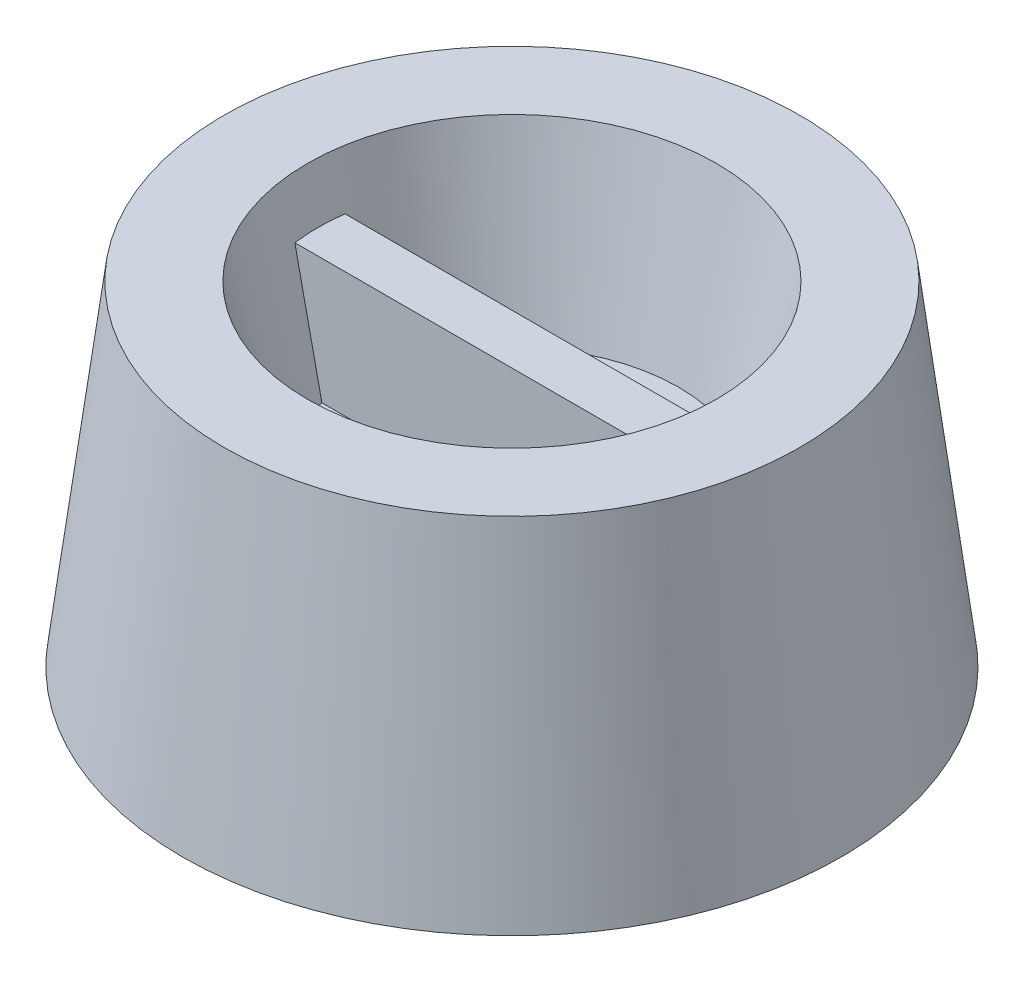
ISO-10303-21;
HEADER;
FILE_DESCRIPTION(('STEP AP214'),'2;1');
FILE_NAME('part.step','',(''),(''),'','','');
FILE_SCHEMA(('AUTOMOTIVE_DESIGN { 1 0 10303 214 1 1 1 1 }'));
ENDSEC;
DATA;
#1=APPLICATION_CONTEXT('core data for automotive mechanical design processes');
#2=APPLICATION_PROTOCOL_DEFINITION('international standard','automotive_design',2000,#1);
#3=PRODUCT_CONTEXT('',#1,'mechanical');
#4=PRODUCT('Part','Part','',(#3));
#5=PRODUCT_RELATED_PRODUCT_CATEGORY('part','',(#4));
#6=PRODUCT_DEFINITION_FORMATION('','',#4);
#7=PRODUCT_DEFINITION_CONTEXT('part definition',#1,'design');
#8=PRODUCT_DEFINITION('design','',#6,#7);
#9=PRODUCT_DEFINITION_SHAPE('','',#8);
#10=(LENGTH_UNIT() NAMED_UNIT(*) SI_UNIT(.MILLI.,.METRE.));
#11=(NAMED_UNIT(*) PLANE_ANGLE_UNIT() SI_UNIT($,.RADIAN.));
#12=(NAMED_UNIT(*) SI_UNIT($,.STERADIAN.) SOLID_ANGLE_UNIT());
#13=UNCERTAINTY_MEASURE_WITH_UNIT(LENGTH_MEASURE(1.E-05),#10,'distance_accuracy_value','');
#14=(GEOMETRIC_REPRESENTATION_CONTEXT(3) GLOBAL_UNCERTAINTY_ASSIGNED_CONTEXT((#13)) GLOBAL_UNIT_ASSIGNED_CONTEXT((#10,
#11,#12)) REPRESENTATION_CONTEXT('',''));
#15=CARTESIAN_POINT('',(0.,0.,0.));
#16=DIRECTION('',(0.,0.,1.));
#17=DIRECTION('',(1.,0.,0.));
#18=AXIS2_PLACEMENT_3D('',#15,#16,#17);
#19=CARTESIAN_POINT('',(0.,3.8,0.));
#20=DIRECTION('',(0.,1.,0.));
#21=DIRECTION('',(0.,0.,1.));
#22=AXIS2_PLACEMENT_3D('',#19,#20,#21);
#23=PLANE('',#22);
#24=DIRECTION('',(1.,0.,0.));
#25=VECTOR('',#24,1.);
#26=CARTESIAN_POINT('',(6.,3.8,-0.600000000000001));
#27=LINE('',#26,#25);
#28=CARTESIAN_POINT('',(-3.95474398665704,3.8,-0.599999999999999));
#29=VERTEX_POINT('',#28);
#30=CARTESIAN_POINT('',(3.95474398665704,3.8,-0.6));
#31=VERTEX_POINT('',#30);
#32=EDGE_CURVE('E92',#29,#31,#27,.T.);
#33=ORIENTED_EDGE('',*,*,#32,.T.);
#34=CARTESIAN_POINT('',(0.,3.8,0.));
#35=DIRECTION('',(0.,1.,0.));
#36=DIRECTION('',(0.,0.,1.));
#37=AXIS2_PLACEMENT_3D('',#34,#35,#36);
#38=CIRCLE('',#37,4.);
#39=EDGE_CURVE('E107',#31,#29,#38,.T.);
#40=ORIENTED_EDGE('',*,*,#39,.T.);
#41=EDGE_LOOP('',(#33,#40));
#42=FACE_BOUND('',#41,.T.);
#43=ADVANCED_FACE('F50',(#42),#23,.T.);
#44=CARTESIAN_POINT('',(0.,8.,0.));
#45=DIRECTION('',(0.,1.,0.));
#46=DIRECTION('',(0.,0.,1.));
#47=AXIS2_PLACEMENT_3D('',#44,#45,#46);
#48=PLANE('',#47);
#49=CARTESIAN_POINT('',(0.,8.,0.));
#50=DIRECTION('',(0.,1.,0.));
#51=DIRECTION('',(0.,0.,1.));
#52=AXIS2_PLACEMENT_3D('',#49,#50,#51);
#53=CIRCLE('',#52,4.9);
#54=CARTESIAN_POINT('',(0.,8.,4.9));
#55=VERTEX_POINT('',#54);
#56=EDGE_CURVE('E116',#55,#55,#53,.T.);
#57=ORIENTED_EDGE('',*,*,#56,.F.);
#58=EDGE_LOOP('',(#57));
#59=FACE_BOUND('',#58,.T.);
#60=CARTESIAN_POINT('',(0.,8.,0.));
#61=DIRECTION('',(0.,1.,0.));
#62=DIRECTION('',(0.,0.,1.));
#63=AXIS2_PLACEMENT_3D('',#60,#61,#62);
#64=CIRCLE('',#63,6.9);
#65=CARTESIAN_POINT('',(0.,8.,6.9));
#66=VERTEX_POINT('',#65);
#67=EDGE_CURVE('E238',#66,#66,#64,.T.);
#68=ORIENTED_EDGE('',*,*,#67,.T.);
#69=EDGE_LOOP('',(#68));
#70=FACE_BOUND('',#69,.T.);
#71=ADVANCED_FACE('F219',(#59,#70),#48,.T.);
#72=CARTESIAN_POINT('',(0.,0.,0.));
#73=DIRECTION('',(0.,1.,0.));
#74=DIRECTION('',(0.,0.,1.));
#75=AXIS2_PLACEMENT_3D('',#72,#73,#74);
#76=PLANE('',#75);
#77=CARTESIAN_POINT('',(0.,0.,0.));
#78=DIRECTION('',(0.,1.,0.));
#79=DIRECTION('',(0.,0.,1.));
#80=AXIS2_PLACEMENT_3D('',#77,#78,#79);
#81=CIRCLE('',#80,6.69066133775522);
#82=CARTESIAN_POINT('',(0.,0.,6.69066133775522));
#83=VERTEX_POINT('',#82);
#84=EDGE_CURVE('E433',#83,#83,#81,.T.);
#85=ORIENTED_EDGE('',*,*,#84,.T.);
#86=EDGE_LOOP('',(#85));
#87=FACE_BOUND('',#86,.T.);
#88=CARTESIAN_POINT('',(0.,0.,0.));
#89=DIRECTION('',(0.,1.,0.));
#90=DIRECTION('',(0.,0.,1.));
#91=AXIS2_PLACEMENT_3D('',#88,#89,#90);
#92=CIRCLE('',#91,7.9);
#93=CARTESIAN_POINT('',(0.,0.,7.9));
#94=VERTEX_POINT('',#93);
#95=EDGE_CURVE('E246',#94,#94,#92,.T.);
#96=ORIENTED_EDGE('',*,*,#95,.F.);
#97=EDGE_LOOP('',(#96));
#98=FACE_BOUND('',#97,.T.);
#99=ADVANCED_FACE('F153',(#87,#98),#76,.F.);
#100=CARTESIAN_POINT('',(0.,8.,0.));
#101=DIRECTION('',(0.,-1.,0.));
#102=DIRECTION('',(0.,0.,-1.));
#103=AXIS2_PLACEMENT_3D('',#100,#101,#102);
#104=CONICAL_SURFACE('',#103,6.9,0.124354994546761);
#105=ORIENTED_EDGE('',*,*,#95,.T.);
#106=EDGE_LOOP('',(#105));
#107=FACE_BOUND('',#106,.T.);
#108=ORIENTED_EDGE('',*,*,#67,.F.);
#109=EDGE_LOOP('',(#108));
#110=FACE_BOUND('',#109,.T.);
#111=ADVANCED_FACE('F145',(#107,#110),#104,.T.);
#112=DIRECTION('',(-1.,0.,0.));
#113=VECTOR('',#112,1.);
#114=CARTESIAN_POINT('',(6.,3.8,0.599999999999999));
#115=LINE('',#114,#113);
#116=CARTESIAN_POINT('',(3.95474398665704,3.8,0.6));
#117=VERTEX_POINT('',#116);
#118=CARTESIAN_POINT('',(-3.95474398665704,3.8,0.600000000000001));
#119=VERTEX_POINT('',#118);
#120=EDGE_CURVE('E100',#117,#119,#115,.T.);
#121=ORIENTED_EDGE('',*,*,#120,.T.);
#122=EDGE_CURVE('E117',#119,#117,#38,.T.);
#123=ORIENTED_EDGE('',*,*,#122,.T.);
#124=EDGE_LOOP('',(#121,#123));
#125=FACE_BOUND('',#124,.T.);
#126=ADVANCED_FACE('F136',(#125),#23,.T.);
#127=CARTESIAN_POINT('',(0.,3.8,0.));
#128=DIRECTION('',(0.,1.,0.));
#129=DIRECTION('',(0.,0.,1.));
#130=AXIS2_PLACEMENT_3D('',#127,#128,#129);
#131=CONICAL_SURFACE('',#130,4.,0.211093333222747);
#132=CARTESIAN_POINT('',(0.,6.8,0.));
#133=DIRECTION('',(0.,1.,0.));
#134=DIRECTION('',(0.,0.,1.));
#135=AXIS2_PLACEMENT_3D('',#132,#133,#134);
#136=CIRCLE('',#135,4.64285714285714);
#137=CARTESIAN_POINT('',(-4.60392467889947,6.8,0.600000000000001));
#138=VERTEX_POINT('',#137);
#139=CARTESIAN_POINT('',(-4.60392467889947,6.8,-0.599999999999999));
#140=VERTEX_POINT('',#139);
#141=EDGE_CURVE('E110',#138,#140,#136,.F.);
#142=ORIENTED_EDGE('',*,*,#141,.T.);
#143=CARTESIAN_POINT('',(-6.81272325030493,17.0491023802552,-0.599999999999999));
#144=CARTESIAN_POINT('',(-6.6145307657107,16.1277863143225,-0.599999999999999));
#145=CARTESIAN_POINT('',(-6.41628087703027,15.2064825861426,-0.599999999999999));
#146=CARTESIAN_POINT('',(-6.01961233165098,13.3639120153824,-0.599999999999999));
#147=CARTESIAN_POINT('',(-5.82119367504875,12.4426451727813,-0.599999999999999));
#148=CARTESIAN_POINT('',(-5.4241340114261,10.6001623322652,-0.599999999999999));
#149=CARTESIAN_POINT('',(-5.22549300508409,9.67894633420409,-0.599999999999999));
#150=CARTESIAN_POINT('',(-4.82789856015377,7.83658118273763,-0.599999999999999));
#151=CARTESIAN_POINT('',(-4.62894512138313,6.91543202937158,-0.599999999999999));
#152=CARTESIAN_POINT('',(-4.20538935705303,4.95672162078468,-0.599999999999999));
#153=CARTESIAN_POINT('',(-3.98072591426456,3.91917358000071,-0.599999999999999));
#154=CARTESIAN_POINT('',(-3.53047538514189,1.8442791838691,-0.599999999999999));
#155=CARTESIAN_POINT('',(-3.30488830009918,0.806932828241591,-0.599999999999999));
#156=CARTESIAN_POINT('',(-2.96523568258453,-0.748812290434334,-0.599999999999999));
#157=CARTESIAN_POINT('',(-2.85180581375368,-1.26734976669481,-0.6));
#158=CARTESIAN_POINT('',(-2.62433349958364,-2.30428988125739,-0.6));
#159=CARTESIAN_POINT('',(-2.51029105482846,-2.82269251968755,-0.6));
#160=CARTESIAN_POINT('',(-2.28130350003669,-3.85930158498009,-0.6));
#161=CARTESIAN_POINT('',(-2.16635838528894,-4.37750801080359,-0.6));
#162=CARTESIAN_POINT('',(-1.99286163074682,-5.15457776472536,-0.6));
#163=CARTESIAN_POINT('',(-1.93484943822383,-5.41356145054457,-0.6));
#164=CARTESIAN_POINT('',(-1.81834187422182,-5.93142042097915,-0.6));
#165=CARTESIAN_POINT('',(-1.75984650213107,-6.19029570545684,-0.6));
#166=CARTESIAN_POINT('',(-1.70104784129718,-6.44910238025518,-0.6));
#167=B_SPLINE_CURVE_WITH_KNOTS('',3,(#143,#144,#145,#146,#147,#148,#149,#150,#151,#152,#153,
#154,#155,#156,#157,#158,#159,#160,#161,#162,#163,#164,#165,#166),.UNSPECIFIED.,.F.,.F.,(4,2,2,
2,2,2,2,2,2,2,2,4),(0.,2.82717740357504,5.65435318971819,8.48152037322576,11.308689207292,
14.4934679017568,17.6782421446218,19.270638517146,20.8630333718024,22.4554365429333,
23.251640683321,24.0478458318962),.UNSPECIFIED.);
#168=EDGE_CURVE('E75',#140,#29,#167,.T.);
#169=ORIENTED_EDGE('',*,*,#168,.T.);
#170=ORIENTED_EDGE('',*,*,#39,.F.);
#171=CARTESIAN_POINT('',(1.70104784129718,-6.44910238025517,-0.6));
#172=CARTESIAN_POINT('',(1.75611464115473,-6.20672752916923,-0.6));
#173=CARTESIAN_POINT('',(1.81091382828594,-5.96429211554176,-0.6));
#174=CARTESIAN_POINT('',(1.92008129167195,-5.47932456051908,-0.6));
#175=CARTESIAN_POINT('',(1.97444956844072,-5.2367924192396,-0.6));
#176=CARTESIAN_POINT('',(2.13706424472467,-4.50908867229128,-0.6));
#177=CARTESIAN_POINT('',(2.24482095160023,-4.02380770461704,-0.6));
#178=CARTESIAN_POINT('',(2.45949648254952,-3.05306200803159,-0.6));
#179=CARTESIAN_POINT('',(2.56641530864127,-2.5675972795659,-0.6));
#180=CARTESIAN_POINT('',(2.7796750469441,-1.59654085146466,-0.6));
#181=CARTESIAN_POINT('',(2.88601595903152,-1.11094915180195,-0.6));
#182=CARTESIAN_POINT('',(3.20443070614492,0.345959597565771,-0.6));
#183=CARTESIAN_POINT('',(3.41589637731236,1.3174095046154,-0.6));
#184=CARTESIAN_POINT('',(3.83792746720443,3.26051257492573,-0.6));
#185=CARTESIAN_POINT('',(4.0484928788518,4.23216573972156,-0.6));
#186=CARTESIAN_POINT('',(4.46905405852563,6.17559478175341,-0.6));
#187=CARTESIAN_POINT('',(4.67904982685437,7.14737065892403,-0.600000000000001));
#188=CARTESIAN_POINT('',(5.21015028856241,9.60737480031594,-0.600000000000001));
#189=CARTESIAN_POINT('',(5.53100430538181,11.0956571691357,-0.600000000000001));
#190=CARTESIAN_POINT('',(6.01190233770873,13.328154975477,-0.600000000000001));
#191=CARTESIAN_POINT('',(6.17213700632437,14.0723293648413,-0.600000000000001));
#192=CARTESIAN_POINT('',(6.49250234175748,15.5607003968058,-0.600000000000001));
#193=CARTESIAN_POINT('',(6.65263300859273,16.3048970394022,-0.600000000000001));
#194=CARTESIAN_POINT('',(6.81272325030493,17.0491023802552,-0.600000000000001));
#195=B_SPLINE_CURVE_WITH_KNOTS('',3,(#171,#172,#173,#174,#175,#176,#177,#178,#179,#180,#181,
#182,#183,#184,#185,#186,#187,#188,#189,#190,#191,#192,#193,#194),.UNSPECIFIED.,.F.,.F.,(4,2,2,
2,2,2,2,2,2,2,2,4),(0.,0.745654447390184,1.49130800529563,2.98260884979113,4.47390610140609,
5.96520367210962,8.94780124966796,11.930422231481,14.9130416302478,19.4804680182223,
21.7641571446666,24.0478458802868),.UNSPECIFIED.);
#196=CARTESIAN_POINT('',(4.60392467889947,6.8,-0.6));
#197=VERTEX_POINT('',#196);
#198=EDGE_CURVE('E95',#31,#197,#195,.T.);
#199=ORIENTED_EDGE('',*,*,#198,.T.);
#200=CARTESIAN_POINT('',(4.60392467889947,6.8,0.6));
#201=VERTEX_POINT('',#200);
#202=EDGE_CURVE('E245',#197,#201,#136,.F.);
#203=ORIENTED_EDGE('',*,*,#202,.T.);
#204=CARTESIAN_POINT('',(6.81272325030493,17.0491023802552,0.599999999999999));
#205=CARTESIAN_POINT('',(6.6145307657107,16.1277863143225,0.599999999999999));
#206=CARTESIAN_POINT('',(6.41628087703027,15.2064825861426,0.599999999999999));
#207=CARTESIAN_POINT('',(6.01961233165098,13.3639120153824,0.599999999999999));
#208=CARTESIAN_POINT('',(5.82119367504875,12.4426451727813,0.599999999999999));
#209=CARTESIAN_POINT('',(5.4241340114261,10.6001623322652,0.599999999999999));
#210=CARTESIAN_POINT('',(5.22549300508409,9.67894633420409,0.6));
#211=CARTESIAN_POINT('',(4.82789856015377,7.83658118273763,0.6));
#212=CARTESIAN_POINT('',(4.62894512138313,6.91543202937158,0.6));
#213=CARTESIAN_POINT('',(4.20538935705303,4.95672162078468,0.6));
#214=CARTESIAN_POINT('',(3.98072591426456,3.91917358000071,0.6));
#215=CARTESIAN_POINT('',(3.53047538514189,1.8442791838691,0.6));
#216=CARTESIAN_POINT('',(3.30488830009918,0.806932828241591,0.6));
#217=CARTESIAN_POINT('',(2.96523568258453,-0.748812290434334,0.6));
#218=CARTESIAN_POINT('',(2.85180581375368,-1.26734976669481,0.6));
#219=CARTESIAN_POINT('',(2.62433349958364,-2.30428988125739,0.6));
#220=CARTESIAN_POINT('',(2.51029105482846,-2.82269251968755,0.6));
#221=CARTESIAN_POINT('',(2.28130350003669,-3.85930158498009,0.6));
#222=CARTESIAN_POINT('',(2.16635838528894,-4.37750801080359,0.6));
#223=CARTESIAN_POINT('',(1.99286163074682,-5.15457776472536,0.6));
#224=CARTESIAN_POINT('',(1.93484943822383,-5.41356145054457,0.6));
#225=CARTESIAN_POINT('',(1.81834187422182,-5.93142042097915,0.6));
#226=CARTESIAN_POINT('',(1.75984650213107,-6.19029570545684,0.6));
#227=CARTESIAN_POINT('',(1.70104784129718,-6.44910238025518,0.6));
#228=B_SPLINE_CURVE_WITH_KNOTS('',3,(#204,#205,#206,#207,#208,#209,#210,#211,#212,#213,#214,
#215,#216,#217,#218,#219,#220,#221,#222,#223,#224,#225,#226,#227),.UNSPECIFIED.,.F.,.F.,(4,2,2,
2,2,2,2,2,2,2,2,4),(0.,2.82717740357504,5.65435318971819,8.48152037322576,11.308689207292,
14.4934679017568,17.6782421446218,19.270638517146,20.8630333718024,22.4554365429333,
23.251640683321,24.0478458318962),.UNSPECIFIED.);
#229=EDGE_CURVE('E251',#201,#117,#228,.T.);
#230=ORIENTED_EDGE('',*,*,#229,.T.);
#231=ORIENTED_EDGE('',*,*,#122,.F.);
#232=CARTESIAN_POINT('',(-1.70104784129718,-6.44910238025517,0.6));
#233=CARTESIAN_POINT('',(-1.75611464115473,-6.20672752916923,0.6));
#234=CARTESIAN_POINT('',(-1.81091382828594,-5.96429211554176,0.6));
#235=CARTESIAN_POINT('',(-1.92008129167195,-5.47932456051908,0.6));
#236=CARTESIAN_POINT('',(-1.97444956844072,-5.2367924192396,0.6));
#237=CARTESIAN_POINT('',(-2.13706424472467,-4.50908867229128,0.6));
#238=CARTESIAN_POINT('',(-2.24482095160023,-4.02380770461704,0.6));
#239=CARTESIAN_POINT('',(-2.45949648254952,-3.05306200803159,0.6));
#240=CARTESIAN_POINT('',(-2.56641530864127,-2.5675972795659,0.6));
#241=CARTESIAN_POINT('',(-2.7796750469441,-1.59654085146466,0.6));
#242=CARTESIAN_POINT('',(-2.88601595903152,-1.11094915180195,0.600000000000001));
#243=CARTESIAN_POINT('',(-3.20443070614492,0.34595959756577,0.600000000000001));
#244=CARTESIAN_POINT('',(-3.41589637731236,1.3174095046154,0.600000000000001));
#245=CARTESIAN_POINT('',(-3.83792746720443,3.26051257492573,0.600000000000001));
#246=CARTESIAN_POINT('',(-4.0484928788518,4.23216573972156,0.600000000000001));
#247=CARTESIAN_POINT('',(-4.46905405852563,6.17559478175341,0.600000000000001));
#248=CARTESIAN_POINT('',(-4.67904982685437,7.14737065892403,0.600000000000001));
#249=CARTESIAN_POINT('',(-5.21015028856241,9.60737480031594,0.600000000000001));
#250=CARTESIAN_POINT('',(-5.53100430538181,11.0956571691357,0.600000000000001));
#251=CARTESIAN_POINT('',(-6.01190233770873,13.328154975477,0.600000000000001));
#252=CARTESIAN_POINT('',(-6.17213700632437,14.0723293648413,0.600000000000001));
#253=CARTESIAN_POINT('',(-6.49250234175748,15.5607003968058,0.600000000000001));
#254=CARTESIAN_POINT('',(-6.65263300859273,16.3048970394022,0.600000000000001));
#255=CARTESIAN_POINT('',(-6.81272325030493,17.0491023802552,0.600000000000001));
#256=B_SPLINE_CURVE_WITH_KNOTS('',3,(#232,#233,#234,#235,#236,#237,#238,#239,#240,#241,#242,
#243,#244,#245,#246,#247,#248,#249,#250,#251,#252,#253,#254,#255),.UNSPECIFIED.,.F.,.F.,(4,2,2,
2,2,2,2,2,2,2,2,4),(0.,0.745654447390184,1.49130800529563,2.98260884979113,4.47390610140609,
5.96520367210962,8.94780124966796,11.930422231481,14.9130416302478,19.4804680182223,
21.7641571446666,24.0478458802868),.UNSPECIFIED.);
#257=EDGE_CURVE('E112',#119,#138,#256,.T.);
#258=ORIENTED_EDGE('',*,*,#257,.T.);
#259=EDGE_LOOP('',(#142,#169,#170,#199,#203,#230,#231,#258));
#260=FACE_BOUND('',#259,.T.);
#261=ORIENTED_EDGE('',*,*,#56,.T.);
#262=EDGE_LOOP('',(#261));
#263=FACE_BOUND('',#262,.T.);
#264=ADVANCED_FACE('F105',(#260,#263),#131,.F.);
#265=CARTESIAN_POINT('',(6.,-8.25985074534507,-0.600000000000001));
#266=DIRECTION('',(0.,0.,-1.));
#267=DIRECTION('',(-1.,0.,0.));
#268=AXIS2_PLACEMENT_3D('',#265,#266,#267);
#269=PLANE('',#268);
#270=ORIENTED_EDGE('',*,*,#168,.F.);
#271=DIRECTION('',(-1.,0.,0.));
#272=VECTOR('',#271,1.);
#273=CARTESIAN_POINT('',(6.,6.8,-0.600000000000001));
#274=LINE('',#273,#272);
#275=EDGE_CURVE('E101',#197,#140,#274,.T.);
#276=ORIENTED_EDGE('',*,*,#275,.F.);
#277=ORIENTED_EDGE('',*,*,#198,.F.);
#278=ORIENTED_EDGE('',*,*,#32,.F.);
#279=EDGE_LOOP('',(#270,#276,#277,#278));
#280=FACE_BOUND('',#279,.T.);
#281=ADVANCED_FACE('F93',(#280),#269,.T.);
#282=CARTESIAN_POINT('',(6.,-8.25985074534507,0.599999999999999));
#283=DIRECTION('',(0.,0.,1.));
#284=DIRECTION('',(1.,0.,0.));
#285=AXIS2_PLACEMENT_3D('',#282,#283,#284);
#286=PLANE('',#285);
#287=ORIENTED_EDGE('',*,*,#229,.F.);
#288=DIRECTION('',(1.,0.,0.));
#289=VECTOR('',#288,1.);
#290=CARTESIAN_POINT('',(6.,6.8,0.599999999999999));
#291=LINE('',#290,#289);
#292=EDGE_CURVE('E67',#138,#201,#291,.T.);
#293=ORIENTED_EDGE('',*,*,#292,.F.);
#294=ORIENTED_EDGE('',*,*,#257,.F.);
#295=ORIENTED_EDGE('',*,*,#120,.F.);
#296=EDGE_LOOP('',(#287,#293,#294,#295));
#297=FACE_BOUND('',#296,.T.);
#298=ADVANCED_FACE('F147',(#297),#286,.T.);
#299=CARTESIAN_POINT('',(0.,6.8,0.));
#300=DIRECTION('',(0.,1.,0.));
#301=DIRECTION('',(0.,0.,1.));
#302=AXIS2_PLACEMENT_3D('',#299,#300,#301);
#303=PLANE('',#302);
#304=ORIENTED_EDGE('',*,*,#141,.F.);
#305=ORIENTED_EDGE('',*,*,#292,.T.);
#306=ORIENTED_EDGE('',*,*,#202,.F.);
#307=ORIENTED_EDGE('',*,*,#275,.T.);
#308=EDGE_LOOP('',(#304,#305,#306,#307));
#309=FACE_BOUND('',#308,.T.);
#310=ADVANCED_FACE('F191',(#309),#303,.T.);
#311=CARTESIAN_POINT('',(0.,7.85115831849295,0.));
#312=DIRECTION('',(0.,-1.,0.));
#313=DIRECTION('',(0.,0.,-1.));
#314=AXIS2_PLACEMENT_3D('',#311,#312,#313);
#315=CONICAL_SURFACE('',#314,5.7092665479436,0.124354994546761);
#316=ORIENTED_EDGE('',*,*,#84,.F.);
#317=EDGE_LOOP('',(#316));
#318=FACE_BOUND('',#317,.T.);
#319=CARTESIAN_POINT('',(0.,6.71323651634556,0.));
#320=DIRECTION('',(0.,-1.,0.));
#321=DIRECTION('',(0.,0.,-1.));
#322=AXIS2_PLACEMENT_3D('',#319,#320,#321);
#323=CIRCLE('',#322,5.85150677321202);
#324=CARTESIAN_POINT('',(0.,6.71323651634556,-5.85150677321202));
#325=VERTEX_POINT('',#324);
#326=EDGE_CURVE('E427',#325,#325,#323,.T.);
#327=ORIENTED_EDGE('',*,*,#326,.F.);
#328=EDGE_LOOP('',(#327));
#329=FACE_BOUND('',#328,.T.);
#330=ADVANCED_FACE('F195',(#318,#329),#315,.F.);
#331=CARTESIAN_POINT('',(0.,3.54856509352295,0.));
#332=DIRECTION('',(0.,1.,0.));
#333=DIRECTION('',(0.,0.,1.));
#334=AXIS2_PLACEMENT_3D('',#331,#332,#333);
#335=CONICAL_SURFACE('',#334,5.17336289689289,0.211093333222747);
#336=CARTESIAN_POINT('',(0.,2.6,0.));
#337=DIRECTION('',(0.,-1.,0.));
#338=DIRECTION('',(0.,0.,-1.));
#339=AXIS2_PLACEMENT_3D('',#336,#337,#338);
#340=CIRCLE('',#339,4.97009894828083);
#341=CARTESIAN_POINT('',(0.,2.6,-4.97009894828083));
#342=VERTEX_POINT('',#341);
#343=EDGE_CURVE('E437',#342,#342,#340,.T.);
#344=ORIENTED_EDGE('',*,*,#343,.F.);
#345=EDGE_LOOP('',(#344));
#346=FACE_BOUND('',#345,.T.);
#347=ORIENTED_EDGE('',*,*,#326,.T.);
#348=EDGE_LOOP('',(#347));
#349=FACE_BOUND('',#348,.T.);
#350=ADVANCED_FACE('F198',(#346,#349),#335,.T.);
#351=CARTESIAN_POINT('',(0.,-14.05756267799,0.));
#352=DIRECTION('',(0.,1.,0.));
#353=DIRECTION('',(0.,0.,1.));
#354=AXIS2_PLACEMENT_3D('',#351,#352,#353);
#355=CYLINDRICAL_SURFACE('',#354,3.95);
#356=CARTESIAN_POINT('',(0.,0.0654786279389652,0.));
#357=DIRECTION('',(0.,1.,0.));
#358=DIRECTION('',(0.,0.,1.));
#359=AXIS2_PLACEMENT_3D('',#356,#357,#358);
#360=CIRCLE('',#359,3.95);
#361=CARTESIAN_POINT('',(0.,0.0654786279389652,3.95));
#362=VERTEX_POINT('',#361);
#363=EDGE_CURVE('E12',#362,#362,#360,.F.);
#364=ORIENTED_EDGE('',*,*,#363,.T.);
#365=EDGE_LOOP('',(#364));
#366=FACE_BOUND('',#365,.T.);
#367=CARTESIAN_POINT('',(0.,2.6,0.));
#368=DIRECTION('',(0.,-1.,0.));
#369=DIRECTION('',(0.,0.,-1.));
#370=AXIS2_PLACEMENT_3D('',#367,#368,#369);
#371=CIRCLE('',#370,3.95);
#372=CARTESIAN_POINT('',(0.,2.6,-3.95));
#373=VERTEX_POINT('',#372);
#374=EDGE_CURVE('E441',#373,#373,#371,.T.);
#375=ORIENTED_EDGE('',*,*,#374,.F.);
#376=EDGE_LOOP('',(#375));
#377=FACE_BOUND('',#376,.T.);
#378=ADVANCED_FACE('F207',(#366,#377),#355,.F.);
#379=CARTESIAN_POINT('',(0.,-14.05756267799,0.));
#380=DIRECTION('',(0.,1.,0.));
#381=DIRECTION('',(0.,0.,1.));
#382=AXIS2_PLACEMENT_3D('',#379,#380,#381);
#383=CYLINDRICAL_SURFACE('',#382,4.97009894828083);
#384=CARTESIAN_POINT('',(0.,0.436764281119453,0.));
#385=DIRECTION('',(0.,1.,0.));
#386=DIRECTION('',(0.,0.,1.));
#387=AXIS2_PLACEMENT_3D('',#384,#385,#386);
#388=CIRCLE('',#387,4.97009894828083);
#389=CARTESIAN_POINT('',(0.,0.436764281119453,4.97009894828083));
#390=VERTEX_POINT('',#389);
#391=EDGE_CURVE('E60',#390,#390,#388,.T.);
#392=ORIENTED_EDGE('',*,*,#391,.T.);
#393=EDGE_LOOP('',(#392));
#394=FACE_BOUND('',#393,.T.);
#395=ORIENTED_EDGE('',*,*,#343,.T.);
#396=EDGE_LOOP('',(#395));
#397=FACE_BOUND('',#396,.T.);
#398=ADVANCED_FACE('F203',(#394,#397),#383,.T.);
#399=CARTESIAN_POINT('',(0.,2.6,0.));
#400=DIRECTION('',(0.,1.,0.));
#401=DIRECTION('',(0.,0.,1.));
#402=AXIS2_PLACEMENT_3D('',#399,#400,#401);
#403=PLANE('',#402);
#404=ORIENTED_EDGE('',*,*,#374,.T.);
#405=EDGE_LOOP('',(#404));
#406=FACE_BOUND('',#405,.T.);
#407=ADVANCED_FACE('F200',(#406),#403,.F.);
#408=CARTESIAN_POINT('',(0.,0.436764281119453,0.));
#409=DIRECTION('',(0.,1.,0.));
#410=DIRECTION('',(0.,0.,1.));
#411=AXIS2_PLACEMENT_3D('',#408,#409,#410);
#412=CONICAL_SURFACE('',#411,4.97009894828083,1.22173047639602);
#413=ORIENTED_EDGE('',*,*,#363,.F.);
#414=EDGE_LOOP('',(#413));
#415=FACE_BOUND('',#414,.T.);
#416=ORIENTED_EDGE('',*,*,#391,.F.);
#417=EDGE_LOOP('',(#416));
#418=FACE_BOUND('',#417,.T.);
#419=ADVANCED_FACE('F53',(#415,#418),#412,.T.);
#420=CLOSED_SHELL('',(#43,#71,#99,#111,#126,#264,#281,#298,#310,#330,#350,#378,#398,#407,#419));
#421=MANIFOLD_SOLID_BREP('B2',#420);
#422=ADVANCED_BREP_SHAPE_REPRESENTATION('',(#18,#421),#14);
#423=SHAPE_DEFINITION_REPRESENTATION(#9,#422);
ENDSEC;
END-ISO-10303-21;
